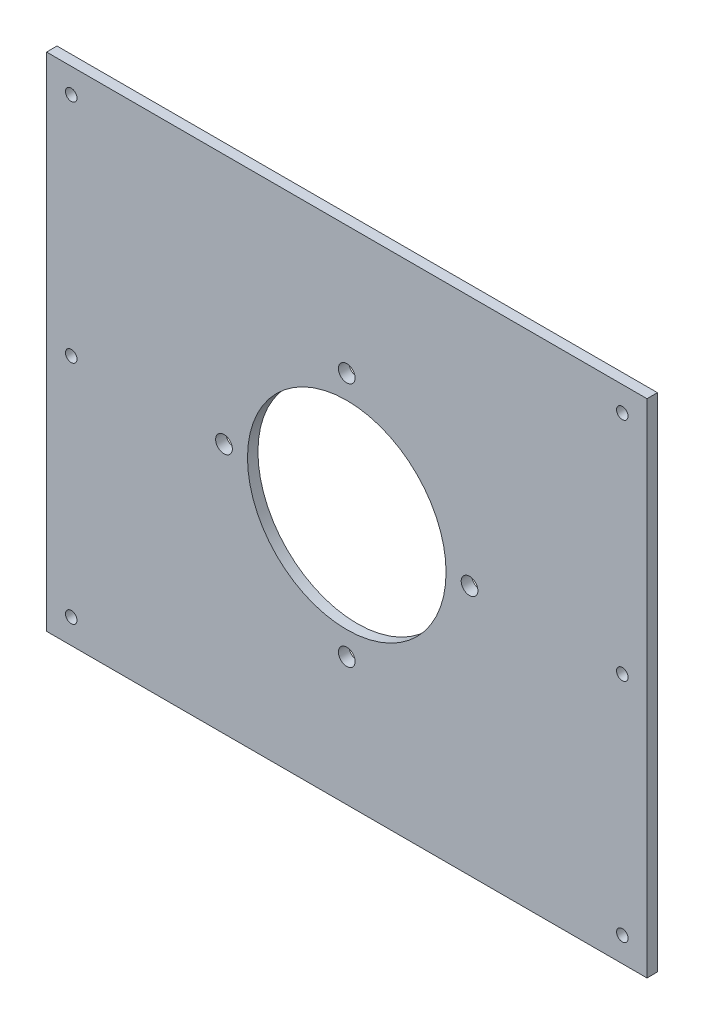
ISO-10303-21;
HEADER;
FILE_DESCRIPTION(('STEP AP214'),'2;1');
FILE_NAME('part.step','',(''),(''),'','','');
FILE_SCHEMA(('AUTOMOTIVE_DESIGN { 1 0 10303 214 1 1 1 1 }'));
ENDSEC;
DATA;
#1=APPLICATION_CONTEXT('core data for automotive mechanical design processes');
#2=APPLICATION_PROTOCOL_DEFINITION('international standard','automotive_design',2000,#1);
#3=PRODUCT_CONTEXT('',#1,'mechanical');
#4=PRODUCT('Part','Part','',(#3));
#5=PRODUCT_RELATED_PRODUCT_CATEGORY('part','',(#4));
#6=PRODUCT_DEFINITION_FORMATION('','',#4);
#7=PRODUCT_DEFINITION_CONTEXT('part definition',#1,'design');
#8=PRODUCT_DEFINITION('design','',#6,#7);
#9=PRODUCT_DEFINITION_SHAPE('','',#8);
#10=(LENGTH_UNIT() NAMED_UNIT(*) SI_UNIT(.MILLI.,.METRE.));
#11=(NAMED_UNIT(*) PLANE_ANGLE_UNIT() SI_UNIT($,.RADIAN.));
#12=(NAMED_UNIT(*) SI_UNIT($,.STERADIAN.) SOLID_ANGLE_UNIT());
#13=UNCERTAINTY_MEASURE_WITH_UNIT(LENGTH_MEASURE(1.E-05),#10,'distance_accuracy_value','');
#14=(GEOMETRIC_REPRESENTATION_CONTEXT(3) GLOBAL_UNCERTAINTY_ASSIGNED_CONTEXT((#13)) GLOBAL_UNIT_ASSIGNED_CONTEXT((#10,
#11,#12)) REPRESENTATION_CONTEXT('',''));
#15=CARTESIAN_POINT('',(0.,0.,0.));
#16=DIRECTION('',(0.,0.,1.));
#17=DIRECTION('',(1.,0.,0.));
#18=AXIS2_PLACEMENT_3D('',#15,#16,#17);
#19=CARTESIAN_POINT('',(284.599217301175,0.,6.35));
#20=DIRECTION('',(-1.,0.,0.));
#21=DIRECTION('',(0.,0.,1.));
#22=AXIS2_PLACEMENT_3D('',#19,#20,#21);
#23=PLANE('',#22);
#24=DIRECTION('',(0.,1.,0.));
#25=VECTOR('',#24,1.);
#26=CARTESIAN_POINT('',(284.599217301175,0.,0.));
#27=LINE('',#26,#25);
#28=CARTESIAN_POINT('',(284.599217301175,-94.5007587101256,0.));
#29=VERTEX_POINT('',#28);
#30=CARTESIAN_POINT('',(284.599217301175,210.299241289874,0.));
#31=VERTEX_POINT('',#30);
#32=EDGE_CURVE('E157',#29,#31,#27,.T.);
#33=ORIENTED_EDGE('',*,*,#32,.T.);
#34=DIRECTION('',(0.,0.,-1.));
#35=VECTOR('',#34,1.);
#36=CARTESIAN_POINT('',(284.599217301175,210.299241289874,6.35));
#37=LINE('',#36,#35);
#38=CARTESIAN_POINT('',(284.599217301175,210.299241289874,6.35));
#39=VERTEX_POINT('',#38);
#40=EDGE_CURVE('E11',#39,#31,#37,.T.);
#41=ORIENTED_EDGE('',*,*,#40,.F.);
#42=DIRECTION('',(0.,1.,0.));
#43=VECTOR('',#42,1.);
#44=CARTESIAN_POINT('',(284.599217301175,0.,6.35));
#45=LINE('',#44,#43);
#46=CARTESIAN_POINT('',(284.599217301175,-94.5007587101256,6.35));
#47=VERTEX_POINT('',#46);
#48=EDGE_CURVE('E85',#47,#39,#45,.T.);
#49=ORIENTED_EDGE('',*,*,#48,.F.);
#50=DIRECTION('',(0.,0.,-1.));
#51=VECTOR('',#50,1.);
#52=CARTESIAN_POINT('',(284.599217301175,-94.5007587101256,6.35));
#53=LINE('',#52,#51);
#54=EDGE_CURVE('E144',#47,#29,#53,.T.);
#55=ORIENTED_EDGE('',*,*,#54,.T.);
#56=EDGE_LOOP('',(#33,#41,#49,#55));
#57=FACE_BOUND('',#56,.T.);
#58=ADVANCED_FACE('F44',(#57),#23,.F.);
#59=CARTESIAN_POINT('',(0.,210.299241289874,6.35));
#60=DIRECTION('',(0.,1.,0.));
#61=DIRECTION('',(0.,0.,1.));
#62=AXIS2_PLACEMENT_3D('',#59,#60,#61);
#63=PLANE('',#62);
#64=DIRECTION('',(1.,0.,0.));
#65=VECTOR('',#64,1.);
#66=CARTESIAN_POINT('',(0.,210.299241289874,0.));
#67=LINE('',#66,#65);
#68=CARTESIAN_POINT('',(-80.200782698825,210.299241289874,0.));
#69=VERTEX_POINT('',#68);
#70=EDGE_CURVE('E94',#69,#31,#67,.T.);
#71=ORIENTED_EDGE('',*,*,#70,.F.);
#72=DIRECTION('',(0.,0.,-1.));
#73=VECTOR('',#72,1.);
#74=CARTESIAN_POINT('',(-80.200782698825,210.299241289874,6.35));
#75=LINE('',#74,#73);
#76=CARTESIAN_POINT('',(-80.200782698825,210.299241289874,6.35));
#77=VERTEX_POINT('',#76);
#78=EDGE_CURVE('E54',#77,#69,#75,.T.);
#79=ORIENTED_EDGE('',*,*,#78,.F.);
#80=DIRECTION('',(1.,0.,0.));
#81=VECTOR('',#80,1.);
#82=CARTESIAN_POINT('',(0.,210.299241289874,6.35));
#83=LINE('',#82,#81);
#84=EDGE_CURVE('E92',#77,#39,#83,.T.);
#85=ORIENTED_EDGE('',*,*,#84,.T.);
#86=ORIENTED_EDGE('',*,*,#40,.T.);
#87=EDGE_LOOP('',(#71,#79,#85,#86));
#88=FACE_BOUND('',#87,.T.);
#89=ADVANCED_FACE('F91',(#88),#63,.T.);
#90=CARTESIAN_POINT('',(-80.200782698825,0.,6.35));
#91=DIRECTION('',(-1.,0.,0.));
#92=DIRECTION('',(0.,0.,1.));
#93=AXIS2_PLACEMENT_3D('',#90,#91,#92);
#94=PLANE('',#93);
#95=DIRECTION('',(0.,1.,0.));
#96=VECTOR('',#95,1.);
#97=CARTESIAN_POINT('',(-80.200782698825,0.,0.));
#98=LINE('',#97,#96);
#99=CARTESIAN_POINT('',(-80.200782698825,-94.5007587101256,0.));
#100=VERTEX_POINT('',#99);
#101=EDGE_CURVE('E163',#100,#69,#98,.T.);
#102=ORIENTED_EDGE('',*,*,#101,.F.);
#103=DIRECTION('',(0.,0.,-1.));
#104=VECTOR('',#103,1.);
#105=CARTESIAN_POINT('',(-80.200782698825,-94.5007587101256,6.35));
#106=LINE('',#105,#104);
#107=CARTESIAN_POINT('',(-80.200782698825,-94.5007587101256,6.35));
#108=VERTEX_POINT('',#107);
#109=EDGE_CURVE('E77',#108,#100,#106,.T.);
#110=ORIENTED_EDGE('',*,*,#109,.F.);
#111=DIRECTION('',(0.,1.,0.));
#112=VECTOR('',#111,1.);
#113=CARTESIAN_POINT('',(-80.200782698825,0.,6.35));
#114=LINE('',#113,#112);
#115=EDGE_CURVE('E102',#108,#77,#114,.T.);
#116=ORIENTED_EDGE('',*,*,#115,.T.);
#117=ORIENTED_EDGE('',*,*,#78,.T.);
#118=EDGE_LOOP('',(#102,#110,#116,#117));
#119=FACE_BOUND('',#118,.T.);
#120=ADVANCED_FACE('F105',(#119),#94,.T.);
#121=CARTESIAN_POINT('',(-65.200782698825,195.299241289874,6.35));
#122=DIRECTION('',(0.,0.,-1.));
#123=DIRECTION('',(-1.,0.,0.));
#124=AXIS2_PLACEMENT_3D('',#121,#122,#123);
#125=CYLINDRICAL_SURFACE('',#124,3.50000000000001);
#126=CARTESIAN_POINT('',(-65.200782698825,195.299241289874,6.35));
#127=DIRECTION('',(0.,0.,1.));
#128=DIRECTION('',(1.,0.,0.));
#129=AXIS2_PLACEMENT_3D('',#126,#127,#128);
#130=CIRCLE('',#129,3.50000000000001);
#131=CARTESIAN_POINT('',(-61.700782698825,195.299241289874,6.35));
#132=VERTEX_POINT('',#131);
#133=EDGE_CURVE('E136',#132,#132,#130,.T.);
#134=ORIENTED_EDGE('',*,*,#133,.T.);
#135=EDGE_LOOP('',(#134));
#136=FACE_BOUND('',#135,.T.);
#137=CARTESIAN_POINT('',(-65.200782698825,195.299241289874,0.));
#138=DIRECTION('',(0.,0.,1.));
#139=DIRECTION('',(1.,0.,0.));
#140=AXIS2_PLACEMENT_3D('',#137,#138,#139);
#141=CIRCLE('',#140,3.50000000000001);
#142=CARTESIAN_POINT('',(-61.700782698825,195.299241289874,0.));
#143=VERTEX_POINT('',#142);
#144=EDGE_CURVE('E192',#143,#143,#141,.T.);
#145=ORIENTED_EDGE('',*,*,#144,.F.);
#146=EDGE_LOOP('',(#145));
#147=FACE_BOUND('',#146,.T.);
#148=ADVANCED_FACE('F390',(#136,#147),#125,.F.);
#149=CARTESIAN_POINT('',(269.599217301175,57.8992412898744,6.35));
#150=DIRECTION('',(0.,0.,-1.));
#151=DIRECTION('',(-1.,0.,0.));
#152=AXIS2_PLACEMENT_3D('',#149,#150,#151);
#153=CYLINDRICAL_SURFACE('',#152,3.50000000000002);
#154=CARTESIAN_POINT('',(269.599217301175,57.8992412898744,6.35));
#155=DIRECTION('',(0.,0.,1.));
#156=DIRECTION('',(1.,0.,0.));
#157=AXIS2_PLACEMENT_3D('',#154,#155,#156);
#158=CIRCLE('',#157,3.50000000000002);
#159=CARTESIAN_POINT('',(273.099217301175,57.8992412898744,6.35));
#160=VERTEX_POINT('',#159);
#161=EDGE_CURVE('E132',#160,#160,#158,.T.);
#162=ORIENTED_EDGE('',*,*,#161,.T.);
#163=EDGE_LOOP('',(#162));
#164=FACE_BOUND('',#163,.T.);
#165=CARTESIAN_POINT('',(269.599217301175,57.8992412898744,0.));
#166=DIRECTION('',(0.,0.,1.));
#167=DIRECTION('',(1.,0.,0.));
#168=AXIS2_PLACEMENT_3D('',#165,#166,#167);
#169=CIRCLE('',#168,3.50000000000002);
#170=CARTESIAN_POINT('',(273.099217301175,57.8992412898744,0.));
#171=VERTEX_POINT('',#170);
#172=EDGE_CURVE('E188',#171,#171,#169,.T.);
#173=ORIENTED_EDGE('',*,*,#172,.F.);
#174=EDGE_LOOP('',(#173));
#175=FACE_BOUND('',#174,.T.);
#176=ADVANCED_FACE('F381',(#164,#175),#153,.F.);
#177=CARTESIAN_POINT('',(269.599217301175,-79.5007587101256,6.35));
#178=DIRECTION('',(0.,0.,-1.));
#179=DIRECTION('',(-1.,0.,0.));
#180=AXIS2_PLACEMENT_3D('',#177,#178,#179);
#181=CYLINDRICAL_SURFACE('',#180,3.50000000000002);
#182=CARTESIAN_POINT('',(269.599217301175,-79.5007587101256,6.35));
#183=DIRECTION('',(0.,0.,1.));
#184=DIRECTION('',(1.,0.,0.));
#185=AXIS2_PLACEMENT_3D('',#182,#183,#184);
#186=CIRCLE('',#185,3.50000000000002);
#187=CARTESIAN_POINT('',(273.099217301175,-79.5007587101256,6.35));
#188=VERTEX_POINT('',#187);
#189=EDGE_CURVE('E128',#188,#188,#186,.T.);
#190=ORIENTED_EDGE('',*,*,#189,.T.);
#191=EDGE_LOOP('',(#190));
#192=FACE_BOUND('',#191,.T.);
#193=CARTESIAN_POINT('',(269.599217301175,-79.5007587101256,0.));
#194=DIRECTION('',(0.,0.,1.));
#195=DIRECTION('',(1.,0.,0.));
#196=AXIS2_PLACEMENT_3D('',#193,#194,#195);
#197=CIRCLE('',#196,3.50000000000002);
#198=CARTESIAN_POINT('',(273.099217301175,-79.5007587101256,0.));
#199=VERTEX_POINT('',#198);
#200=EDGE_CURVE('E184',#199,#199,#197,.T.);
#201=ORIENTED_EDGE('',*,*,#200,.F.);
#202=EDGE_LOOP('',(#201));
#203=FACE_BOUND('',#202,.T.);
#204=ADVANCED_FACE('F372',(#192,#203),#181,.F.);
#205=CARTESIAN_POINT('',(102.199217301175,-16.7007587351256,6.35));
#206=DIRECTION('',(0.,0.,-1.));
#207=DIRECTION('',(-1.,0.,0.));
#208=AXIS2_PLACEMENT_3D('',#205,#206,#207);
#209=CYLINDRICAL_SURFACE('',#208,5.08);
#210=CARTESIAN_POINT('',(102.199217301175,-16.7007587351256,6.35));
#211=DIRECTION('',(0.,0.,1.));
#212=DIRECTION('',(1.,0.,0.));
#213=AXIS2_PLACEMENT_3D('',#210,#211,#212);
#214=CIRCLE('',#213,5.08);
#215=CARTESIAN_POINT('',(107.279217301175,-16.7007587351256,6.35));
#216=VERTEX_POINT('',#215);
#217=EDGE_CURVE('E124',#216,#216,#214,.T.);
#218=ORIENTED_EDGE('',*,*,#217,.T.);
#219=EDGE_LOOP('',(#218));
#220=FACE_BOUND('',#219,.T.);
#221=CARTESIAN_POINT('',(102.199217301175,-16.7007587351256,0.));
#222=DIRECTION('',(0.,0.,1.));
#223=DIRECTION('',(1.,0.,0.));
#224=AXIS2_PLACEMENT_3D('',#221,#222,#223);
#225=CIRCLE('',#224,5.08);
#226=CARTESIAN_POINT('',(107.279217301175,-16.7007587351256,0.));
#227=VERTEX_POINT('',#226);
#228=EDGE_CURVE('E180',#227,#227,#225,.T.);
#229=ORIENTED_EDGE('',*,*,#228,.F.);
#230=EDGE_LOOP('',(#229));
#231=FACE_BOUND('',#230,.T.);
#232=ADVANCED_FACE('F363',(#220,#231),#209,.F.);
#233=CARTESIAN_POINT('',(176.799217326175,57.8992412898744,6.35));
#234=DIRECTION('',(0.,0.,-1.));
#235=DIRECTION('',(-1.,0.,0.));
#236=AXIS2_PLACEMENT_3D('',#233,#234,#235);
#237=CYLINDRICAL_SURFACE('',#236,5.07999999999999);
#238=CARTESIAN_POINT('',(176.799217326175,57.8992412898744,6.35));
#239=DIRECTION('',(0.,0.,1.));
#240=DIRECTION('',(1.,0.,0.));
#241=AXIS2_PLACEMENT_3D('',#238,#239,#240);
#242=CIRCLE('',#241,5.07999999999999);
#243=CARTESIAN_POINT('',(181.879217326175,57.8992412898744,6.35));
#244=VERTEX_POINT('',#243);
#245=EDGE_CURVE('E120',#244,#244,#242,.T.);
#246=ORIENTED_EDGE('',*,*,#245,.T.);
#247=EDGE_LOOP('',(#246));
#248=FACE_BOUND('',#247,.T.);
#249=CARTESIAN_POINT('',(176.799217326175,57.8992412898744,0.));
#250=DIRECTION('',(0.,0.,1.));
#251=DIRECTION('',(1.,0.,0.));
#252=AXIS2_PLACEMENT_3D('',#249,#250,#251);
#253=CIRCLE('',#252,5.07999999999999);
#254=CARTESIAN_POINT('',(181.879217326175,57.8992412898744,0.));
#255=VERTEX_POINT('',#254);
#256=EDGE_CURVE('E176',#255,#255,#253,.T.);
#257=ORIENTED_EDGE('',*,*,#256,.F.);
#258=EDGE_LOOP('',(#257));
#259=FACE_BOUND('',#258,.T.);
#260=ADVANCED_FACE('F354',(#248,#259),#237,.F.);
#261=CARTESIAN_POINT('',(102.199217301175,132.499241314874,6.35));
#262=DIRECTION('',(0.,0.,-1.));
#263=DIRECTION('',(-1.,0.,0.));
#264=AXIS2_PLACEMENT_3D('',#261,#262,#263);
#265=CYLINDRICAL_SURFACE('',#264,5.08);
#266=CARTESIAN_POINT('',(102.199217301175,132.499241314874,6.35));
#267=DIRECTION('',(0.,0.,1.));
#268=DIRECTION('',(1.,0.,0.));
#269=AXIS2_PLACEMENT_3D('',#266,#267,#268);
#270=CIRCLE('',#269,5.08);
#271=CARTESIAN_POINT('',(107.279217301175,132.499241314874,6.35));
#272=VERTEX_POINT('',#271);
#273=EDGE_CURVE('E116',#272,#272,#270,.T.);
#274=ORIENTED_EDGE('',*,*,#273,.T.);
#275=EDGE_LOOP('',(#274));
#276=FACE_BOUND('',#275,.T.);
#277=CARTESIAN_POINT('',(102.199217301175,132.499241314874,0.));
#278=DIRECTION('',(0.,0.,1.));
#279=DIRECTION('',(1.,0.,0.));
#280=AXIS2_PLACEMENT_3D('',#277,#278,#279);
#281=CIRCLE('',#280,5.08);
#282=CARTESIAN_POINT('',(107.279217301175,132.499241314874,0.));
#283=VERTEX_POINT('',#282);
#284=EDGE_CURVE('E172',#283,#283,#281,.T.);
#285=ORIENTED_EDGE('',*,*,#284,.F.);
#286=EDGE_LOOP('',(#285));
#287=FACE_BOUND('',#286,.T.);
#288=ADVANCED_FACE('F345',(#276,#287),#265,.F.);
#289=CARTESIAN_POINT('',(269.599217301175,195.299241289874,6.35));
#290=DIRECTION('',(0.,0.,-1.));
#291=DIRECTION('',(-1.,0.,0.));
#292=AXIS2_PLACEMENT_3D('',#289,#290,#291);
#293=CYLINDRICAL_SURFACE('',#292,3.50000000000002);
#294=CARTESIAN_POINT('',(269.599217301175,195.299241289874,6.35));
#295=DIRECTION('',(0.,0.,1.));
#296=DIRECTION('',(1.,0.,0.));
#297=AXIS2_PLACEMENT_3D('',#294,#295,#296);
#298=CIRCLE('',#297,3.50000000000002);
#299=CARTESIAN_POINT('',(273.099217301175,195.299241289874,6.35));
#300=VERTEX_POINT('',#299);
#301=EDGE_CURVE('E109',#300,#300,#298,.T.);
#302=ORIENTED_EDGE('',*,*,#301,.T.);
#303=EDGE_LOOP('',(#302));
#304=FACE_BOUND('',#303,.T.);
#305=CARTESIAN_POINT('',(269.599217301175,195.299241289874,0.));
#306=DIRECTION('',(0.,0.,1.));
#307=DIRECTION('',(1.,0.,0.));
#308=AXIS2_PLACEMENT_3D('',#305,#306,#307);
#309=CIRCLE('',#308,3.50000000000002);
#310=CARTESIAN_POINT('',(273.099217301175,195.299241289874,0.));
#311=VERTEX_POINT('',#310);
#312=EDGE_CURVE('E168',#311,#311,#309,.T.);
#313=ORIENTED_EDGE('',*,*,#312,.F.);
#314=EDGE_LOOP('',(#313));
#315=FACE_BOUND('',#314,.T.);
#316=ADVANCED_FACE('F337',(#304,#315),#293,.F.);
#317=CARTESIAN_POINT('',(0.,-94.5007587101256,6.35));
#318=DIRECTION('',(0.,1.,0.));
#319=DIRECTION('',(0.,0.,1.));
#320=AXIS2_PLACEMENT_3D('',#317,#318,#319);
#321=PLANE('',#320);
#322=DIRECTION('',(1.,0.,0.));
#323=VECTOR('',#322,1.);
#324=CARTESIAN_POINT('',(0.,-94.5007587101256,0.));
#325=LINE('',#324,#323);
#326=EDGE_CURVE('E80',#100,#29,#325,.T.);
#327=ORIENTED_EDGE('',*,*,#326,.T.);
#328=ORIENTED_EDGE('',*,*,#54,.F.);
#329=DIRECTION('',(1.,0.,0.));
#330=VECTOR('',#329,1.);
#331=CARTESIAN_POINT('',(0.,-94.5007587101256,6.35));
#332=LINE('',#331,#330);
#333=EDGE_CURVE('E62',#108,#47,#332,.T.);
#334=ORIENTED_EDGE('',*,*,#333,.F.);
#335=ORIENTED_EDGE('',*,*,#109,.T.);
#336=EDGE_LOOP('',(#327,#328,#334,#335));
#337=FACE_BOUND('',#336,.T.);
#338=ADVANCED_FACE('F251',(#337),#321,.F.);
#339=CARTESIAN_POINT('',(-65.200782698825,-79.5007587101256,6.35));
#340=DIRECTION('',(0.,0.,-1.));
#341=DIRECTION('',(-1.,0.,0.));
#342=AXIS2_PLACEMENT_3D('',#339,#340,#341);
#343=CYLINDRICAL_SURFACE('',#342,3.5);
#344=CARTESIAN_POINT('',(-65.200782698825,-79.5007587101256,6.35));
#345=DIRECTION('',(0.,0.,1.));
#346=DIRECTION('',(1.,0.,0.));
#347=AXIS2_PLACEMENT_3D('',#344,#345,#346);
#348=CIRCLE('',#347,3.5);
#349=CARTESIAN_POINT('',(-61.700782698825,-79.5007587101256,6.35));
#350=VERTEX_POINT('',#349);
#351=EDGE_CURVE('E268',#350,#350,#348,.T.);
#352=ORIENTED_EDGE('',*,*,#351,.T.);
#353=EDGE_LOOP('',(#352));
#354=FACE_BOUND('',#353,.T.);
#355=CARTESIAN_POINT('',(-65.200782698825,-79.5007587101256,0.));
#356=DIRECTION('',(0.,0.,1.));
#357=DIRECTION('',(1.,0.,0.));
#358=AXIS2_PLACEMENT_3D('',#355,#356,#357);
#359=CIRCLE('',#358,3.5);
#360=CARTESIAN_POINT('',(-61.700782698825,-79.5007587101256,0.));
#361=VERTEX_POINT('',#360);
#362=EDGE_CURVE('E153',#361,#361,#359,.T.);
#363=ORIENTED_EDGE('',*,*,#362,.F.);
#364=EDGE_LOOP('',(#363));
#365=FACE_BOUND('',#364,.T.);
#366=ADVANCED_FACE('F249',(#354,#365),#343,.F.);
#367=CARTESIAN_POINT('',(27.599217276175,57.8992412898744,6.35));
#368=DIRECTION('',(0.,0.,-1.));
#369=DIRECTION('',(-1.,0.,0.));
#370=AXIS2_PLACEMENT_3D('',#367,#368,#369);
#371=CYLINDRICAL_SURFACE('',#370,5.08000000000001);
#372=CARTESIAN_POINT('',(27.599217276175,57.8992412898744,6.35));
#373=DIRECTION('',(0.,0.,1.));
#374=DIRECTION('',(1.,0.,0.));
#375=AXIS2_PLACEMENT_3D('',#372,#373,#374);
#376=CIRCLE('',#375,5.08000000000001);
#377=CARTESIAN_POINT('',(32.679217276175,57.8992412898744,6.35));
#378=VERTEX_POINT('',#377);
#379=EDGE_CURVE('E260',#378,#378,#376,.T.);
#380=ORIENTED_EDGE('',*,*,#379,.T.);
#381=EDGE_LOOP('',(#380));
#382=FACE_BOUND('',#381,.T.);
#383=CARTESIAN_POINT('',(27.599217276175,57.8992412898744,0.));
#384=DIRECTION('',(0.,0.,1.));
#385=DIRECTION('',(1.,0.,0.));
#386=AXIS2_PLACEMENT_3D('',#383,#384,#385);
#387=CIRCLE('',#386,5.08000000000001);
#388=CARTESIAN_POINT('',(32.679217276175,57.8992412898744,0.));
#389=VERTEX_POINT('',#388);
#390=EDGE_CURVE('E149',#389,#389,#387,.T.);
#391=ORIENTED_EDGE('',*,*,#390,.F.);
#392=EDGE_LOOP('',(#391));
#393=FACE_BOUND('',#392,.T.);
#394=ADVANCED_FACE('F238',(#382,#393),#371,.F.);
#395=CARTESIAN_POINT('',(102.199217301175,57.8992412898744,6.35));
#396=DIRECTION('',(0.,0.,-1.));
#397=DIRECTION('',(-1.,0.,0.));
#398=AXIS2_PLACEMENT_3D('',#395,#396,#397);
#399=CYLINDRICAL_SURFACE('',#398,60.325);
#400=CARTESIAN_POINT('',(102.199217301175,57.8992412898744,6.35));
#401=DIRECTION('',(0.,0.,1.));
#402=DIRECTION('',(1.,0.,0.));
#403=AXIS2_PLACEMENT_3D('',#400,#401,#402);
#404=CIRCLE('',#403,60.325);
#405=CARTESIAN_POINT('',(162.524217301175,57.8992412898744,6.35));
#406=VERTEX_POINT('',#405);
#407=EDGE_CURVE('E200',#406,#406,#404,.T.);
#408=ORIENTED_EDGE('',*,*,#407,.T.);
#409=EDGE_LOOP('',(#408));
#410=FACE_BOUND('',#409,.T.);
#411=CARTESIAN_POINT('',(102.199217301175,57.8992412898744,0.));
#412=DIRECTION('',(0.,0.,1.));
#413=DIRECTION('',(1.,0.,0.));
#414=AXIS2_PLACEMENT_3D('',#411,#412,#413);
#415=CIRCLE('',#414,60.325);
#416=CARTESIAN_POINT('',(162.524217301175,57.8992412898744,0.));
#417=VERTEX_POINT('',#416);
#418=EDGE_CURVE('E145',#417,#417,#415,.T.);
#419=ORIENTED_EDGE('',*,*,#418,.F.);
#420=EDGE_LOOP('',(#419));
#421=FACE_BOUND('',#420,.T.);
#422=ADVANCED_FACE('F46',(#410,#421),#399,.F.);
#423=CARTESIAN_POINT('',(-65.200782698825,57.8992412898744,6.35));
#424=DIRECTION('',(0.,0.,-1.));
#425=DIRECTION('',(-1.,0.,0.));
#426=AXIS2_PLACEMENT_3D('',#423,#424,#425);
#427=CYLINDRICAL_SURFACE('',#426,3.5);
#428=CARTESIAN_POINT('',(-65.200782698825,57.8992412898744,6.35));
#429=DIRECTION('',(0.,0.,1.));
#430=DIRECTION('',(1.,0.,0.));
#431=AXIS2_PLACEMENT_3D('',#428,#429,#430);
#432=CIRCLE('',#431,3.5);
#433=CARTESIAN_POINT('',(-61.700782698825,57.8992412898744,6.35));
#434=VERTEX_POINT('',#433);
#435=EDGE_CURVE('E140',#434,#434,#432,.T.);
#436=ORIENTED_EDGE('',*,*,#435,.T.);
#437=EDGE_LOOP('',(#436));
#438=FACE_BOUND('',#437,.T.);
#439=CARTESIAN_POINT('',(-65.200782698825,57.8992412898744,0.));
#440=DIRECTION('',(0.,0.,1.));
#441=DIRECTION('',(1.,0.,0.));
#442=AXIS2_PLACEMENT_3D('',#439,#440,#441);
#443=CIRCLE('',#442,3.5);
#444=CARTESIAN_POINT('',(-61.700782698825,57.8992412898744,0.));
#445=VERTEX_POINT('',#444);
#446=EDGE_CURVE('E196',#445,#445,#443,.T.);
#447=ORIENTED_EDGE('',*,*,#446,.F.);
#448=EDGE_LOOP('',(#447));
#449=FACE_BOUND('',#448,.T.);
#450=ADVANCED_FACE('F228',(#438,#449),#427,.F.);
#451=CARTESIAN_POINT('',(0.,0.,6.35));
#452=DIRECTION('',(0.,0.,1.));
#453=DIRECTION('',(1.,0.,0.));
#454=AXIS2_PLACEMENT_3D('',#451,#452,#453);
#455=PLANE('',#454);
#456=ORIENTED_EDGE('',*,*,#407,.F.);
#457=EDGE_LOOP('',(#456));
#458=FACE_BOUND('',#457,.T.);
#459=ORIENTED_EDGE('',*,*,#379,.F.);
#460=EDGE_LOOP('',(#459));
#461=FACE_BOUND('',#460,.T.);
#462=ORIENTED_EDGE('',*,*,#351,.F.);
#463=EDGE_LOOP('',(#462));
#464=FACE_BOUND('',#463,.T.);
#465=ORIENTED_EDGE('',*,*,#48,.T.);
#466=ORIENTED_EDGE('',*,*,#84,.F.);
#467=ORIENTED_EDGE('',*,*,#115,.F.);
#468=ORIENTED_EDGE('',*,*,#333,.T.);
#469=EDGE_LOOP('',(#465,#466,#467,#468));
#470=FACE_BOUND('',#469,.T.);
#471=ORIENTED_EDGE('',*,*,#301,.F.);
#472=EDGE_LOOP('',(#471));
#473=FACE_BOUND('',#472,.T.);
#474=ORIENTED_EDGE('',*,*,#273,.F.);
#475=EDGE_LOOP('',(#474));
#476=FACE_BOUND('',#475,.T.);
#477=ORIENTED_EDGE('',*,*,#245,.F.);
#478=EDGE_LOOP('',(#477));
#479=FACE_BOUND('',#478,.T.);
#480=ORIENTED_EDGE('',*,*,#217,.F.);
#481=EDGE_LOOP('',(#480));
#482=FACE_BOUND('',#481,.T.);
#483=ORIENTED_EDGE('',*,*,#189,.F.);
#484=EDGE_LOOP('',(#483));
#485=FACE_BOUND('',#484,.T.);
#486=ORIENTED_EDGE('',*,*,#161,.F.);
#487=EDGE_LOOP('',(#486));
#488=FACE_BOUND('',#487,.T.);
#489=ORIENTED_EDGE('',*,*,#133,.F.);
#490=EDGE_LOOP('',(#489));
#491=FACE_BOUND('',#490,.T.);
#492=ORIENTED_EDGE('',*,*,#435,.F.);
#493=EDGE_LOOP('',(#492));
#494=FACE_BOUND('',#493,.T.);
#495=ADVANCED_FACE('F100',(#458,#461,#464,#470,#473,#476,#479,#482,#485,#488,#491,#494),#455,.T.);
#496=CARTESIAN_POINT('',(0.,0.,0.));
#497=DIRECTION('',(0.,0.,1.));
#498=DIRECTION('',(1.,0.,0.));
#499=AXIS2_PLACEMENT_3D('',#496,#497,#498);
#500=PLANE('',#499);
#501=ORIENTED_EDGE('',*,*,#418,.T.);
#502=EDGE_LOOP('',(#501));
#503=FACE_BOUND('',#502,.T.);
#504=ORIENTED_EDGE('',*,*,#390,.T.);
#505=EDGE_LOOP('',(#504));
#506=FACE_BOUND('',#505,.T.);
#507=ORIENTED_EDGE('',*,*,#362,.T.);
#508=EDGE_LOOP('',(#507));
#509=FACE_BOUND('',#508,.T.);
#510=ORIENTED_EDGE('',*,*,#32,.F.);
#511=ORIENTED_EDGE('',*,*,#326,.F.);
#512=ORIENTED_EDGE('',*,*,#101,.T.);
#513=ORIENTED_EDGE('',*,*,#70,.T.);
#514=EDGE_LOOP('',(#510,#511,#512,#513));
#515=FACE_BOUND('',#514,.T.);
#516=ORIENTED_EDGE('',*,*,#312,.T.);
#517=EDGE_LOOP('',(#516));
#518=FACE_BOUND('',#517,.T.);
#519=ORIENTED_EDGE('',*,*,#284,.T.);
#520=EDGE_LOOP('',(#519));
#521=FACE_BOUND('',#520,.T.);
#522=ORIENTED_EDGE('',*,*,#256,.T.);
#523=EDGE_LOOP('',(#522));
#524=FACE_BOUND('',#523,.T.);
#525=ORIENTED_EDGE('',*,*,#228,.T.);
#526=EDGE_LOOP('',(#525));
#527=FACE_BOUND('',#526,.T.);
#528=ORIENTED_EDGE('',*,*,#200,.T.);
#529=EDGE_LOOP('',(#528));
#530=FACE_BOUND('',#529,.T.);
#531=ORIENTED_EDGE('',*,*,#172,.T.);
#532=EDGE_LOOP('',(#531));
#533=FACE_BOUND('',#532,.T.);
#534=ORIENTED_EDGE('',*,*,#144,.T.);
#535=EDGE_LOOP('',(#534));
#536=FACE_BOUND('',#535,.T.);
#537=ORIENTED_EDGE('',*,*,#446,.T.);
#538=EDGE_LOOP('',(#537));
#539=FACE_BOUND('',#538,.T.);
#540=ADVANCED_FACE('F207',(#503,#506,#509,#515,#518,#521,#524,#527,#530,#533,#536,#539),#500,.F.);
#541=CLOSED_SHELL('',(#58,#89,#120,#148,#176,#204,#232,#260,#288,#316,#338,#366,#394,#422,#450,
#495,#540));
#542=MANIFOLD_SOLID_BREP('B2',#541);
#543=ADVANCED_BREP_SHAPE_REPRESENTATION('',(#18,#542),#14);
#544=SHAPE_DEFINITION_REPRESENTATION(#9,#543);
ENDSEC;
END-ISO-10303-21;
